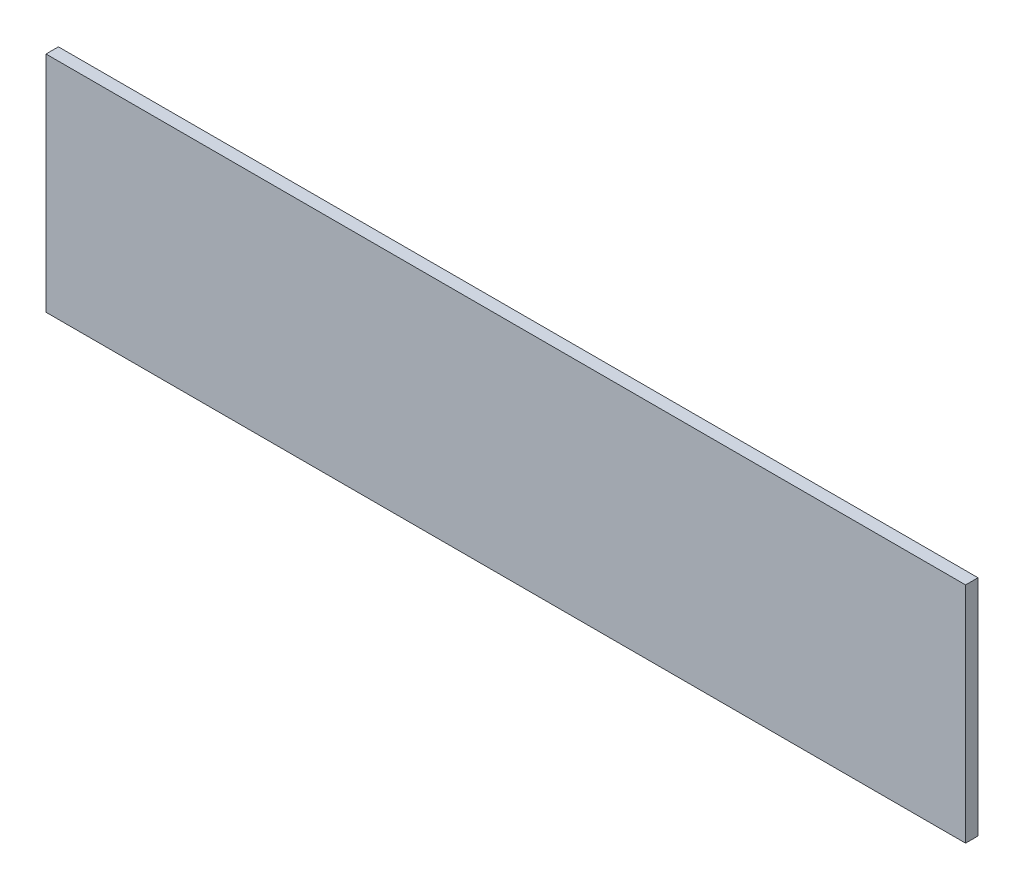
ISO-10303-21;
HEADER;
FILE_DESCRIPTION(('STEP AP214'),'2;1');
FILE_NAME('part.step','',(''),(''),'','','');
FILE_SCHEMA(('AUTOMOTIVE_DESIGN { 1 0 10303 214 1 1 1 1 }'));
ENDSEC;
DATA;
#1=APPLICATION_CONTEXT('core data for automotive mechanical design processes');
#2=APPLICATION_PROTOCOL_DEFINITION('international standard','automotive_design',2000,#1);
#3=PRODUCT_CONTEXT('',#1,'mechanical');
#4=PRODUCT('Part','Part','',(#3));
#5=PRODUCT_RELATED_PRODUCT_CATEGORY('part','',(#4));
#6=PRODUCT_DEFINITION_FORMATION('','',#4);
#7=PRODUCT_DEFINITION_CONTEXT('part definition',#1,'design');
#8=PRODUCT_DEFINITION('design','',#6,#7);
#9=PRODUCT_DEFINITION_SHAPE('','',#8);
#10=(LENGTH_UNIT() NAMED_UNIT(*) SI_UNIT(.MILLI.,.METRE.));
#11=(NAMED_UNIT(*) PLANE_ANGLE_UNIT() SI_UNIT($,.RADIAN.));
#12=(NAMED_UNIT(*) SI_UNIT($,.STERADIAN.) SOLID_ANGLE_UNIT());
#13=UNCERTAINTY_MEASURE_WITH_UNIT(LENGTH_MEASURE(1.E-05),#10,'distance_accuracy_value','');
#14=(GEOMETRIC_REPRESENTATION_CONTEXT(3) GLOBAL_UNCERTAINTY_ASSIGNED_CONTEXT((#13)) GLOBAL_UNIT_ASSIGNED_CONTEXT((#10,
#11,#12)) REPRESENTATION_CONTEXT('',''));
#15=CARTESIAN_POINT('',(0.,0.,0.));
#16=DIRECTION('',(0.,0.,1.));
#17=DIRECTION('',(1.,0.,0.));
#18=AXIS2_PLACEMENT_3D('',#15,#16,#17);
#19=CARTESIAN_POINT('',(185.,45.,5.));
#20=DIRECTION('',(-1.,0.,0.));
#21=DIRECTION('',(0.,0.,1.));
#22=AXIS2_PLACEMENT_3D('',#19,#20,#21);
#23=PLANE('',#22);
#24=DIRECTION('',(0.,1.,0.));
#25=VECTOR('',#24,1.);
#26=CARTESIAN_POINT('',(185.,45.,0.));
#27=LINE('',#26,#25);
#28=CARTESIAN_POINT('',(185.,-45.,0.));
#29=VERTEX_POINT('',#28);
#30=CARTESIAN_POINT('',(185.,45.,0.));
#31=VERTEX_POINT('',#30);
#32=EDGE_CURVE('E104',#29,#31,#27,.T.);
#33=ORIENTED_EDGE('',*,*,#32,.T.);
#34=DIRECTION('',(0.,0.,-1.));
#35=VECTOR('',#34,1.);
#36=CARTESIAN_POINT('',(185.,45.,5.));
#37=LINE('',#36,#35);
#38=CARTESIAN_POINT('',(185.,45.,5.));
#39=VERTEX_POINT('',#38);
#40=EDGE_CURVE('E11',#39,#31,#37,.T.);
#41=ORIENTED_EDGE('',*,*,#40,.F.);
#42=DIRECTION('',(0.,1.,0.));
#43=VECTOR('',#42,1.);
#44=CARTESIAN_POINT('',(185.,45.,5.));
#45=LINE('',#44,#43);
#46=CARTESIAN_POINT('',(185.,-45.,5.));
#47=VERTEX_POINT('',#46);
#48=EDGE_CURVE('E92',#47,#39,#45,.T.);
#49=ORIENTED_EDGE('',*,*,#48,.F.);
#50=DIRECTION('',(0.,0.,-1.));
#51=VECTOR('',#50,1.);
#52=CARTESIAN_POINT('',(185.,-45.,5.));
#53=LINE('',#52,#51);
#54=EDGE_CURVE('E100',#47,#29,#53,.T.);
#55=ORIENTED_EDGE('',*,*,#54,.T.);
#56=EDGE_LOOP('',(#33,#41,#49,#55));
#57=FACE_BOUND('',#56,.T.);
#58=ADVANCED_FACE('F41',(#57),#23,.F.);
#59=CARTESIAN_POINT('',(-185.,45.,5.));
#60=DIRECTION('',(0.,-1.,0.));
#61=DIRECTION('',(0.,0.,-1.));
#62=AXIS2_PLACEMENT_3D('',#59,#60,#61);
#63=PLANE('',#62);
#64=DIRECTION('',(-1.,0.,0.));
#65=VECTOR('',#64,1.);
#66=CARTESIAN_POINT('',(-185.,45.,0.));
#67=LINE('',#66,#65);
#68=CARTESIAN_POINT('',(-185.,45.,0.));
#69=VERTEX_POINT('',#68);
#70=EDGE_CURVE('E96',#31,#69,#67,.T.);
#71=ORIENTED_EDGE('',*,*,#70,.T.);
#72=DIRECTION('',(0.,0.,-1.));
#73=VECTOR('',#72,1.);
#74=CARTESIAN_POINT('',(-185.,45.,5.));
#75=LINE('',#74,#73);
#76=CARTESIAN_POINT('',(-185.,45.,5.));
#77=VERTEX_POINT('',#76);
#78=EDGE_CURVE('E49',#77,#69,#75,.T.);
#79=ORIENTED_EDGE('',*,*,#78,.F.);
#80=DIRECTION('',(-1.,0.,0.));
#81=VECTOR('',#80,1.);
#82=CARTESIAN_POINT('',(-185.,45.,5.));
#83=LINE('',#82,#81);
#84=EDGE_CURVE('E87',#39,#77,#83,.T.);
#85=ORIENTED_EDGE('',*,*,#84,.F.);
#86=ORIENTED_EDGE('',*,*,#40,.T.);
#87=EDGE_LOOP('',(#71,#79,#85,#86));
#88=FACE_BOUND('',#87,.T.);
#89=ADVANCED_FACE('F95',(#88),#63,.F.);
#90=CARTESIAN_POINT('',(-185.,45.,5.));
#91=DIRECTION('',(1.,0.,0.));
#92=DIRECTION('',(0.,0.,-1.));
#93=AXIS2_PLACEMENT_3D('',#90,#91,#92);
#94=PLANE('',#93);
#95=DIRECTION('',(0.,-1.,0.));
#96=VECTOR('',#95,1.);
#97=CARTESIAN_POINT('',(-185.,45.,0.));
#98=LINE('',#97,#96);
#99=CARTESIAN_POINT('',(-185.,-45.,0.));
#100=VERTEX_POINT('',#99);
#101=EDGE_CURVE('E74',#69,#100,#98,.T.);
#102=ORIENTED_EDGE('',*,*,#101,.T.);
#103=DIRECTION('',(0.,0.,-1.));
#104=VECTOR('',#103,1.);
#105=CARTESIAN_POINT('',(-185.,-45.,5.));
#106=LINE('',#105,#104);
#107=CARTESIAN_POINT('',(-185.,-45.,5.));
#108=VERTEX_POINT('',#107);
#109=EDGE_CURVE('E97',#108,#100,#106,.T.);
#110=ORIENTED_EDGE('',*,*,#109,.F.);
#111=DIRECTION('',(0.,-1.,0.));
#112=VECTOR('',#111,1.);
#113=CARTESIAN_POINT('',(-185.,45.,5.));
#114=LINE('',#113,#112);
#115=EDGE_CURVE('E90',#77,#108,#114,.T.);
#116=ORIENTED_EDGE('',*,*,#115,.F.);
#117=ORIENTED_EDGE('',*,*,#78,.T.);
#118=EDGE_LOOP('',(#102,#110,#116,#117));
#119=FACE_BOUND('',#118,.T.);
#120=ADVANCED_FACE('F98',(#119),#94,.F.);
#121=CARTESIAN_POINT('',(-185.,-45.,5.));
#122=DIRECTION('',(0.,1.,0.));
#123=DIRECTION('',(0.,0.,1.));
#124=AXIS2_PLACEMENT_3D('',#121,#122,#123);
#125=PLANE('',#124);
#126=DIRECTION('',(1.,0.,0.));
#127=VECTOR('',#126,1.);
#128=CARTESIAN_POINT('',(-185.,-45.,0.));
#129=LINE('',#128,#127);
#130=EDGE_CURVE('E80',#100,#29,#129,.T.);
#131=ORIENTED_EDGE('',*,*,#130,.T.);
#132=ORIENTED_EDGE('',*,*,#54,.F.);
#133=DIRECTION('',(1.,0.,0.));
#134=VECTOR('',#133,1.);
#135=CARTESIAN_POINT('',(-185.,-45.,5.));
#136=LINE('',#135,#134);
#137=EDGE_CURVE('E57',#108,#47,#136,.T.);
#138=ORIENTED_EDGE('',*,*,#137,.F.);
#139=ORIENTED_EDGE('',*,*,#109,.T.);
#140=EDGE_LOOP('',(#131,#132,#138,#139));
#141=FACE_BOUND('',#140,.T.);
#142=ADVANCED_FACE('F111',(#141),#125,.F.);
#143=CARTESIAN_POINT('',(0.,0.,5.));
#144=DIRECTION('',(0.,0.,1.));
#145=DIRECTION('',(1.,0.,0.));
#146=AXIS2_PLACEMENT_3D('',#143,#144,#145);
#147=PLANE('',#146);
#148=ORIENTED_EDGE('',*,*,#48,.T.);
#149=ORIENTED_EDGE('',*,*,#84,.T.);
#150=ORIENTED_EDGE('',*,*,#115,.T.);
#151=ORIENTED_EDGE('',*,*,#137,.T.);
#152=EDGE_LOOP('',(#148,#149,#150,#151));
#153=FACE_BOUND('',#152,.T.);
#154=ADVANCED_FACE('F88',(#153),#147,.T.);
#155=CARTESIAN_POINT('',(0.,0.,0.));
#156=DIRECTION('',(0.,0.,1.));
#157=DIRECTION('',(1.,0.,0.));
#158=AXIS2_PLACEMENT_3D('',#155,#156,#157);
#159=PLANE('',#158);
#160=ORIENTED_EDGE('',*,*,#32,.F.);
#161=ORIENTED_EDGE('',*,*,#130,.F.);
#162=ORIENTED_EDGE('',*,*,#101,.F.);
#163=ORIENTED_EDGE('',*,*,#70,.F.);
#164=EDGE_LOOP('',(#160,#161,#162,#163));
#165=FACE_BOUND('',#164,.T.);
#166=ADVANCED_FACE('F114',(#165),#159,.F.);
#167=CLOSED_SHELL('',(#58,#89,#120,#142,#154,#166));
#168=MANIFOLD_SOLID_BREP('B2',#167);
#169=ADVANCED_BREP_SHAPE_REPRESENTATION('',(#18,#168),#14);
#170=SHAPE_DEFINITION_REPRESENTATION(#9,#169);
ENDSEC;
END-ISO-10303-21;
